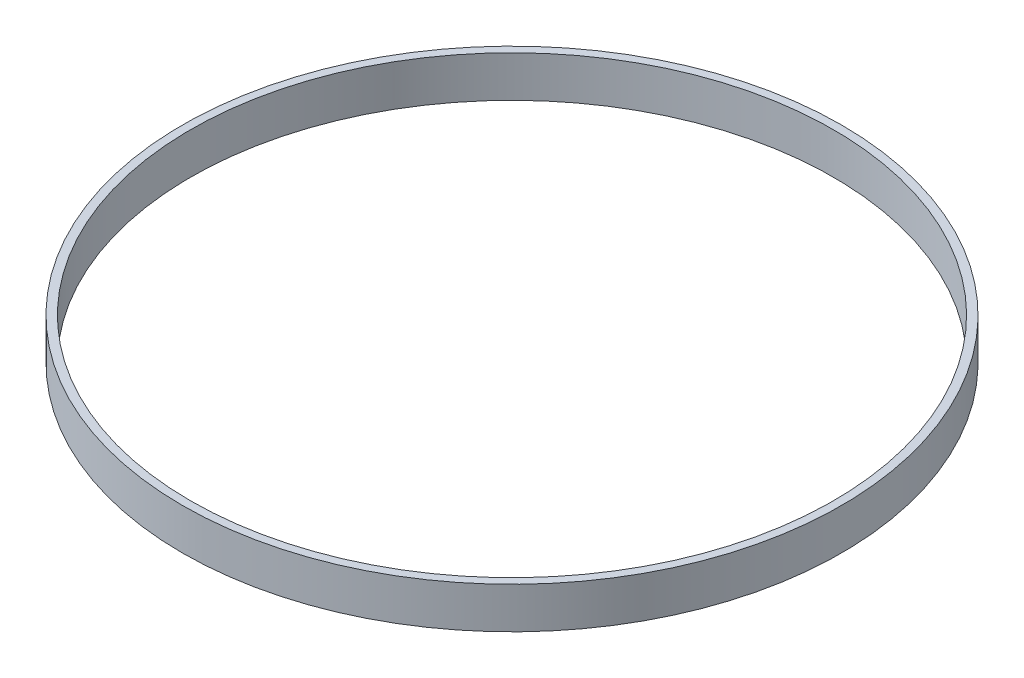
ISO-10303-21;
HEADER;
FILE_DESCRIPTION(('STEP AP214'),'2;1');
FILE_NAME('part.step','',(''),(''),'','','');
FILE_SCHEMA(('AUTOMOTIVE_DESIGN { 1 0 10303 214 1 1 1 1 }'));
ENDSEC;
DATA;
#1=APPLICATION_CONTEXT('core data for automotive mechanical design processes');
#2=APPLICATION_PROTOCOL_DEFINITION('international standard','automotive_design',2000,#1);
#3=PRODUCT_CONTEXT('',#1,'mechanical');
#4=PRODUCT('Part','Part','',(#3));
#5=PRODUCT_RELATED_PRODUCT_CATEGORY('part','',(#4));
#6=PRODUCT_DEFINITION_FORMATION('','',#4);
#7=PRODUCT_DEFINITION_CONTEXT('part definition',#1,'design');
#8=PRODUCT_DEFINITION('design','',#6,#7);
#9=PRODUCT_DEFINITION_SHAPE('','',#8);
#10=(LENGTH_UNIT() NAMED_UNIT(*) SI_UNIT(.MILLI.,.METRE.));
#11=(NAMED_UNIT(*) PLANE_ANGLE_UNIT() SI_UNIT($,.RADIAN.));
#12=(NAMED_UNIT(*) SI_UNIT($,.STERADIAN.) SOLID_ANGLE_UNIT());
#13=UNCERTAINTY_MEASURE_WITH_UNIT(LENGTH_MEASURE(1.E-05),#10,'distance_accuracy_value','');
#14=(GEOMETRIC_REPRESENTATION_CONTEXT(3) GLOBAL_UNCERTAINTY_ASSIGNED_CONTEXT((#13)) GLOBAL_UNIT_ASSIGNED_CONTEXT((#10,
#11,#12)) REPRESENTATION_CONTEXT('',''));
#15=CARTESIAN_POINT('',(0.,0.,0.));
#16=DIRECTION('',(0.,0.,1.));
#17=DIRECTION('',(1.,0.,0.));
#18=AXIS2_PLACEMENT_3D('',#15,#16,#17);
#19=CARTESIAN_POINT('',(0.,12.7,0.));
#20=DIRECTION('',(0.,1.,0.));
#21=DIRECTION('',(0.,0.,1.));
#22=AXIS2_PLACEMENT_3D('',#19,#20,#21);
#23=PLANE('',#22);
#24=CARTESIAN_POINT('',(0.,12.7,0.));
#25=DIRECTION('',(0.,1.,0.));
#26=DIRECTION('',(0.,0.,1.));
#27=AXIS2_PLACEMENT_3D('',#24,#25,#26);
#28=CIRCLE('',#27,101.6);
#29=CARTESIAN_POINT('',(0.,12.7,101.6));
#30=VERTEX_POINT('',#29);
#31=EDGE_CURVE('E11',#30,#30,#28,.T.);
#32=ORIENTED_EDGE('',*,*,#31,.T.);
#33=EDGE_LOOP('',(#32));
#34=FACE_BOUND('',#33,.T.);
#35=CARTESIAN_POINT('',(0.,12.7,0.));
#36=DIRECTION('',(0.,1.,0.));
#37=DIRECTION('',(0.,0.,1.));
#38=AXIS2_PLACEMENT_3D('',#35,#36,#37);
#39=CIRCLE('',#38,99.1);
#40=CARTESIAN_POINT('',(0.,12.7,99.1));
#41=VERTEX_POINT('',#40);
#42=EDGE_CURVE('E54',#41,#41,#39,.T.);
#43=ORIENTED_EDGE('',*,*,#42,.F.);
#44=EDGE_LOOP('',(#43));
#45=FACE_BOUND('',#44,.T.);
#46=ADVANCED_FACE('F43',(#34,#45),#23,.T.);
#47=CARTESIAN_POINT('',(0.,0.,0.));
#48=DIRECTION('',(0.,1.,0.));
#49=DIRECTION('',(0.,0.,1.));
#50=AXIS2_PLACEMENT_3D('',#47,#48,#49);
#51=PLANE('',#50);
#52=CARTESIAN_POINT('',(0.,0.,0.));
#53=DIRECTION('',(0.,1.,0.));
#54=DIRECTION('',(0.,0.,1.));
#55=AXIS2_PLACEMENT_3D('',#52,#53,#54);
#56=CIRCLE('',#55,101.6);
#57=CARTESIAN_POINT('',(0.,0.,101.6));
#58=VERTEX_POINT('',#57);
#59=EDGE_CURVE('E47',#58,#58,#56,.T.);
#60=ORIENTED_EDGE('',*,*,#59,.F.);
#61=EDGE_LOOP('',(#60));
#62=FACE_BOUND('',#61,.T.);
#63=CARTESIAN_POINT('',(0.,0.,0.));
#64=DIRECTION('',(0.,1.,0.));
#65=DIRECTION('',(0.,0.,1.));
#66=AXIS2_PLACEMENT_3D('',#63,#64,#65);
#67=CIRCLE('',#66,99.1);
#68=CARTESIAN_POINT('',(0.,0.,99.1));
#69=VERTEX_POINT('',#68);
#70=EDGE_CURVE('E56',#69,#69,#67,.T.);
#71=ORIENTED_EDGE('',*,*,#70,.T.);
#72=EDGE_LOOP('',(#71));
#73=FACE_BOUND('',#72,.T.);
#74=ADVANCED_FACE('F66',(#62,#73),#51,.F.);
#75=CARTESIAN_POINT('',(0.,12.7,0.));
#76=DIRECTION('',(0.,-1.,0.));
#77=DIRECTION('',(0.,0.,-1.));
#78=AXIS2_PLACEMENT_3D('',#75,#76,#77);
#79=CYLINDRICAL_SURFACE('',#78,101.6);
#80=ORIENTED_EDGE('',*,*,#31,.F.);
#81=EDGE_LOOP('',(#80));
#82=FACE_BOUND('',#81,.T.);
#83=ORIENTED_EDGE('',*,*,#59,.T.);
#84=EDGE_LOOP('',(#83));
#85=FACE_BOUND('',#84,.T.);
#86=ADVANCED_FACE('F45',(#82,#85),#79,.T.);
#87=CARTESIAN_POINT('',(0.,12.7,0.));
#88=DIRECTION('',(0.,-1.,0.));
#89=DIRECTION('',(0.,0.,-1.));
#90=AXIS2_PLACEMENT_3D('',#87,#88,#89);
#91=CYLINDRICAL_SURFACE('',#90,99.1);
#92=ORIENTED_EDGE('',*,*,#42,.T.);
#93=EDGE_LOOP('',(#92));
#94=FACE_BOUND('',#93,.T.);
#95=ORIENTED_EDGE('',*,*,#70,.F.);
#96=EDGE_LOOP('',(#95));
#97=FACE_BOUND('',#96,.T.);
#98=ADVANCED_FACE('F62',(#94,#97),#91,.F.);
#99=CLOSED_SHELL('',(#46,#74,#86,#98));
#100=MANIFOLD_SOLID_BREP('B2',#99);
#101=ADVANCED_BREP_SHAPE_REPRESENTATION('',(#18,#100),#14);
#102=SHAPE_DEFINITION_REPRESENTATION(#9,#101);
ENDSEC;
END-ISO-10303-21;
